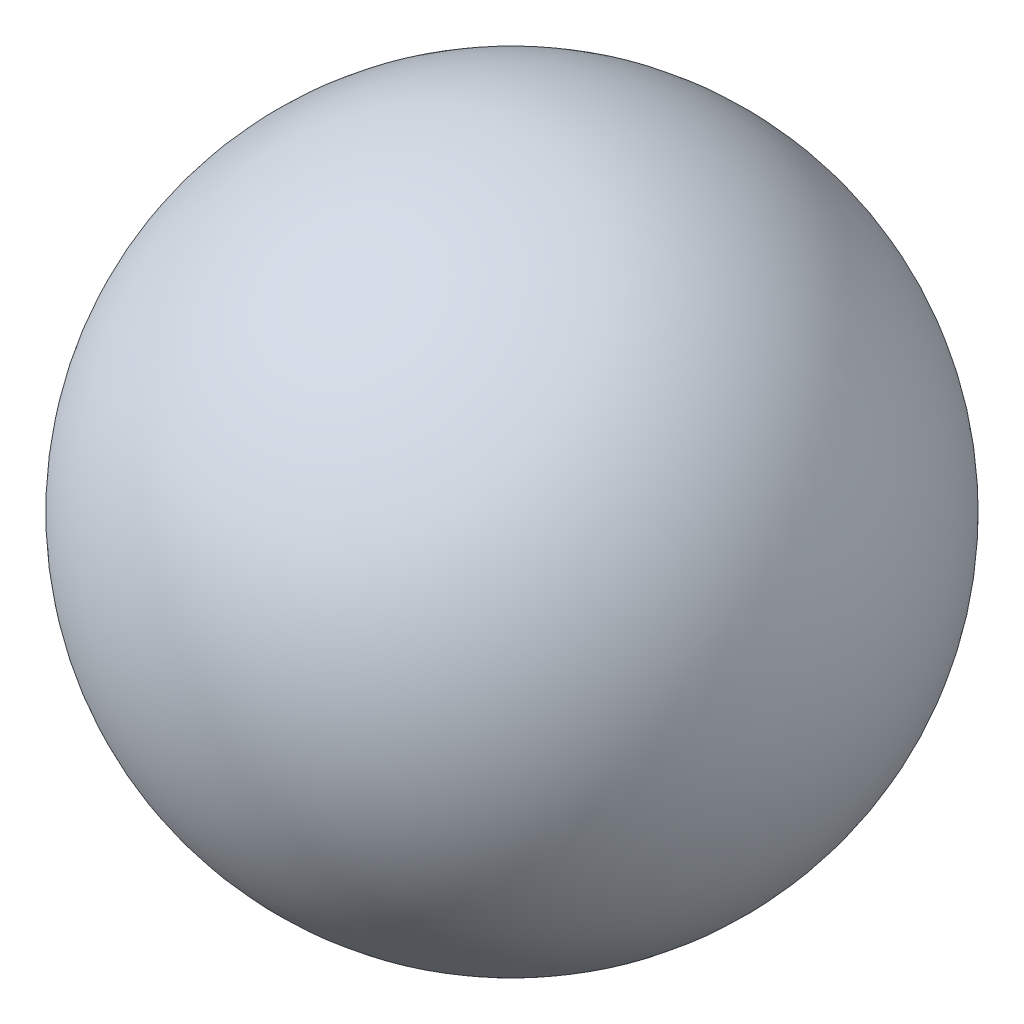
ISO-10303-21;
HEADER;
FILE_DESCRIPTION(('STEP AP214'),'2;1');
FILE_NAME('part.step','',(''),(''),'','','');
FILE_SCHEMA(('AUTOMOTIVE_DESIGN { 1 0 10303 214 1 1 1 1 }'));
ENDSEC;
DATA;
#1=APPLICATION_CONTEXT('core data for automotive mechanical design processes');
#2=APPLICATION_PROTOCOL_DEFINITION('international standard','automotive_design',2000,#1);
#3=PRODUCT_CONTEXT('',#1,'mechanical');
#4=PRODUCT('Part','Part','',(#3));
#5=PRODUCT_RELATED_PRODUCT_CATEGORY('part','',(#4));
#6=PRODUCT_DEFINITION_FORMATION('','',#4);
#7=PRODUCT_DEFINITION_CONTEXT('part definition',#1,'design');
#8=PRODUCT_DEFINITION('design','',#6,#7);
#9=PRODUCT_DEFINITION_SHAPE('','',#8);
#10=(LENGTH_UNIT() NAMED_UNIT(*) SI_UNIT(.MILLI.,.METRE.));
#11=(NAMED_UNIT(*) PLANE_ANGLE_UNIT() SI_UNIT($,.RADIAN.));
#12=(NAMED_UNIT(*) SI_UNIT($,.STERADIAN.) SOLID_ANGLE_UNIT());
#13=UNCERTAINTY_MEASURE_WITH_UNIT(LENGTH_MEASURE(1.E-05),#10,'distance_accuracy_value','');
#14=(GEOMETRIC_REPRESENTATION_CONTEXT(3) GLOBAL_UNCERTAINTY_ASSIGNED_CONTEXT((#13)) GLOBAL_UNIT_ASSIGNED_CONTEXT((#10,
#11,#12)) REPRESENTATION_CONTEXT('',''));
#15=CARTESIAN_POINT('',(0.,0.,0.));
#16=DIRECTION('',(0.,0.,1.));
#17=DIRECTION('',(1.,0.,0.));
#18=AXIS2_PLACEMENT_3D('',#15,#16,#17);
#19=CARTESIAN_POINT('',(0.,0.,0.));
#20=DIRECTION('',(0.,1.,0.));
#21=DIRECTION('',(0.,0.,-1.));
#22=AXIS2_PLACEMENT_3D('',#19,#20,#21);
#23=SPHERICAL_SURFACE('',#22,6.);
#24=CARTESIAN_POINT('',(0.,6.,0.));
#25=VERTEX_POINT('',#24);
#26=VERTEX_LOOP('',#25);
#27=FACE_BOUND('',#26,.T.);
#28=ADVANCED_FACE('F30',(#27),#23,.T.);
#29=CLOSED_SHELL('',(#28));
#30=CARTESIAN_POINT('',(-5.,0.,0.));
#31=DIRECTION('',(1.,0.,0.));
#32=DIRECTION('',(0.,0.,-1.));
#33=AXIS2_PLACEMENT_3D('',#30,#31,#32);
#34=CYLINDRICAL_SURFACE('',#33,1.5);
#35=CARTESIAN_POINT('',(0.,0.,0.));
#36=DIRECTION('',(0.707106781186547,-0.707106781186547,0.));
#37=DIRECTION('',(0.707106781186547,0.707106781186547,0.));
#38=AXIS2_PLACEMENT_3D('',#35,#36,#37);
#39=ELLIPSE('',#38,2.12132034355964,1.5);
#40=CARTESIAN_POINT('',(0.,0.,1.5));
#41=VERTEX_POINT('',#40);
#42=CARTESIAN_POINT('',(0.,0.,-1.5));
#43=VERTEX_POINT('',#42);
#44=EDGE_CURVE('E56',#41,#43,#39,.T.);
#45=ORIENTED_EDGE('',*,*,#44,.T.);
#46=CARTESIAN_POINT('',(0.,0.,0.));
#47=DIRECTION('',(0.707106781186547,0.707106781186547,0.));
#48=DIRECTION('',(0.707106781186547,-0.707106781186547,0.));
#49=AXIS2_PLACEMENT_3D('',#46,#47,#48);
#50=ELLIPSE('',#49,2.12132034355964,1.5);
#51=EDGE_CURVE('E61',#43,#41,#50,.T.);
#52=ORIENTED_EDGE('',*,*,#51,.T.);
#53=EDGE_LOOP('',(#45,#52));
#54=FACE_BOUND('',#53,.T.);
#55=CARTESIAN_POINT('',(-5.,0.,0.));
#56=DIRECTION('',(1.,0.,0.));
#57=DIRECTION('',(0.,0.,-1.));
#58=AXIS2_PLACEMENT_3D('',#55,#56,#57);
#59=CIRCLE('',#58,1.5);
#60=CARTESIAN_POINT('',(-5.,0.,-1.5));
#61=VERTEX_POINT('',#60);
#62=EDGE_CURVE('E11',#61,#61,#59,.T.);
#63=ORIENTED_EDGE('',*,*,#62,.F.);
#64=EDGE_LOOP('',(#63));
#65=FACE_BOUND('',#64,.T.);
#66=ADVANCED_FACE('F69',(#54,#65),#34,.F.);
#67=CARTESIAN_POINT('',(-5.,0.,0.));
#68=DIRECTION('',(1.,0.,0.));
#69=DIRECTION('',(0.,0.,-1.));
#70=AXIS2_PLACEMENT_3D('',#67,#68,#69);
#71=PLANE('',#70);
#72=ORIENTED_EDGE('',*,*,#62,.T.);
#73=EDGE_LOOP('',(#72));
#74=FACE_BOUND('',#73,.T.);
#75=ADVANCED_FACE('F113',(#74),#71,.T.);
#76=CARTESIAN_POINT('',(0.,5.,0.));
#77=DIRECTION('',(0.,1.,0.));
#78=DIRECTION('',(0.,0.,1.));
#79=AXIS2_PLACEMENT_3D('',#76,#77,#78);
#80=PLANE('',#79);
#81=CARTESIAN_POINT('',(0.,5.,0.));
#82=DIRECTION('',(0.,1.,0.));
#83=DIRECTION('',(0.,0.,1.));
#84=AXIS2_PLACEMENT_3D('',#81,#82,#83);
#85=CIRCLE('',#84,1.5);
#86=CARTESIAN_POINT('',(0.,5.,1.5));
#87=VERTEX_POINT('',#86);
#88=EDGE_CURVE('E239',#87,#87,#85,.T.);
#89=ORIENTED_EDGE('',*,*,#88,.F.);
#90=EDGE_LOOP('',(#89));
#91=FACE_BOUND('',#90,.T.);
#92=ADVANCED_FACE('F118',(#91),#80,.F.);
#93=CARTESIAN_POINT('',(0.,-5.,0.));
#94=DIRECTION('',(0.,1.,0.));
#95=DIRECTION('',(0.,0.,1.));
#96=AXIS2_PLACEMENT_3D('',#93,#94,#95);
#97=CYLINDRICAL_SURFACE('',#96,1.5);
#98=CARTESIAN_POINT('',(-1.4142135623731,2.5,-0.5));
#99=CARTESIAN_POINT('',(-1.41421347266367,2.52723408740534,-0.500000128973901));
#100=CARTESIAN_POINT('',(-1.41500884686403,2.55446739988576,-0.49776739184907));
#101=CARTESIAN_POINT('',(-1.4180878708729,2.60812721047531,-0.488925565851282));
#102=CARTESIAN_POINT('',(-1.4203717658361,2.63455357493197,-0.482315756085337));
#103=CARTESIAN_POINT('',(-1.42614101831944,2.68581344650641,-0.464977742840131));
#104=CARTESIAN_POINT('',(-1.4296240198232,2.71064996472344,-0.454257610701));
#105=CARTESIAN_POINT('',(-1.43739561008504,2.7581800242719,-0.429030814221313));
#106=CARTESIAN_POINT('',(-1.44168437652716,2.78087309127625,-0.414523314430261));
#107=CARTESIAN_POINT('',(-1.45077244702794,2.82435998116974,-0.381525573221263));
#108=CARTESIAN_POINT('',(-1.45558447422069,2.84505771433602,-0.362912170688912));
#109=CARTESIAN_POINT('',(-1.46506932400754,2.88310340061216,-0.322493833607244));
#110=CARTESIAN_POINT('',(-1.46974212414549,2.90045081579114,-0.3006883875262));
#111=CARTESIAN_POINT('',(-1.47856933460829,2.93173944866484,-0.253802253982491));
#112=CARTESIAN_POINT('',(-1.48270703850784,2.94557998530899,-0.228650955612258));
#113=CARTESIAN_POINT('',(-1.4898479338551,2.96879579256374,-0.17621561149374));
#114=CARTESIAN_POINT('',(-1.49285143101506,2.97817226658845,-0.148932142843606));
#115=CARTESIAN_POINT('',(-1.49729537715949,2.9918679273162,-0.0940144087167455));
#116=CARTESIAN_POINT('',(-1.49878657388779,2.9963517231285,-0.0664253774264829));
#117=CARTESIAN_POINT('',(-1.50021804109124,3.00065814668033,-0.0108489374120448));
#118=CARTESIAN_POINT('',(-1.50015871131445,3.00048197582621,0.0171383667719471));
#119=CARTESIAN_POINT('',(-1.49853019809368,2.99557787271698,0.0715517575969093));
#120=CARTESIAN_POINT('',(-1.49702032377569,2.99102873576275,0.0979960242958342));
#121=CARTESIAN_POINT('',(-1.49273483669855,2.97780350950977,0.149721719411081));
#122=CARTESIAN_POINT('',(-1.48995913815551,2.96912714051012,0.175003068889588));
#123=CARTESIAN_POINT('',(-1.48337835146652,2.94778934134693,0.224076237421007));
#124=CARTESIAN_POINT('',(-1.47956021262158,2.93507703072661,0.2478441104845));
#125=CARTESIAN_POINT('',(-1.47129196519309,2.90607014727581,0.292962162763585));
#126=CARTESIAN_POINT('',(-1.4668416810017,2.88977457833669,0.314311667192384));
#127=CARTESIAN_POINT('',(-1.45753095925538,2.85316280326962,0.355050433275955));
#128=CARTESIAN_POINT('',(-1.45266107586687,2.83269342107723,0.374300078533784));
#129=CARTESIAN_POINT('',(-1.44323667622202,2.78877563713872,0.40913862979794));
#130=CARTESIAN_POINT('',(-1.43868220864403,2.76532677714357,0.424726971636483));
#131=CARTESIAN_POINT('',(-1.43035262569106,2.7156731871921,0.451993727521386));
#132=CARTESIAN_POINT('',(-1.42658954674447,2.68943393431537,0.463613231825601));
#133=CARTESIAN_POINT('',(-1.42040825434116,2.6352143028676,0.482221596649677));
#134=CARTESIAN_POINT('',(-1.41798947731819,2.6072346593918,0.48921239787748));
#135=CARTESIAN_POINT('',(-1.41489818169014,2.55168082230333,0.498080641044514));
#136=CARTESIAN_POINT('',(-1.41415180223172,2.52414528763032,0.500174547752903));
#137=CARTESIAN_POINT('',(-1.41428336096614,2.4691119254414,0.499802719455807));
#138=CARTESIAN_POINT('',(-1.41516100413602,2.44161409198472,0.497337812612854));
#139=CARTESIAN_POINT('',(-1.41836809028099,2.38842151714123,0.488112825775626));
#140=CARTESIAN_POINT('',(-1.42064662715846,2.36269728492382,0.4815031969902));
#141=CARTESIAN_POINT('',(-1.42634276840086,2.31272819688116,0.464356931280375));
#142=CARTESIAN_POINT('',(-1.42976057468663,2.28848360420481,0.453819598181749));
#143=CARTESIAN_POINT('',(-1.4374843879661,2.24130978957629,0.428737170369428));
#144=CARTESIAN_POINT('',(-1.4418151283247,2.21844667867904,0.414075559179237));
#145=CARTESIAN_POINT('',(-1.45082884365827,2.1754269738082,0.38129281527879));
#146=CARTESIAN_POINT('',(-1.45551192221992,2.15527118066941,0.363170662749394));
#147=CARTESIAN_POINT('',(-1.46497519318826,2.11723600795466,0.322945852950159));
#148=CARTESIAN_POINT('',(-1.46974921788922,2.09951280499057,0.300693635273325));
#149=CARTESIAN_POINT('',(-1.47863425806581,2.06804192882598,0.253413645700129));
#150=CARTESIAN_POINT('',(-1.48274529708854,2.05429411441879,0.228385972432276));
#151=CARTESIAN_POINT('',(-1.48982202905295,2.03128994756914,0.176389931216147));
#152=CARTESIAN_POINT('',(-1.49279515002264,2.02200436142597,0.149435561660598));
#153=CARTESIAN_POINT('',(-1.49729305418889,2.00813612896995,0.094229232923008));
#154=CARTESIAN_POINT('',(-1.4988183601701,2.00355178505975,0.0659777459769445));
#155=CARTESIAN_POINT('',(-1.50020931618128,1.99936896119718,0.0104076679300201));
#156=CARTESIAN_POINT('',(-1.50014960044721,1.99954627303381,-0.0168923619600098));
#157=CARTESIAN_POINT('',(-1.49856098259698,2.0043286540732,-0.071055572500087));
#158=CARTESIAN_POINT('',(-1.49703219966784,2.00893336407638,-0.0979187884095278));
#159=CARTESIAN_POINT('',(-1.4927045747721,2.02229111728798,-0.15002105971603));
#160=CARTESIAN_POINT('',(-1.4899262918059,2.03097710767648,-0.175279135456398));
#161=CARTESIAN_POINT('',(-1.48338580352232,2.05218876554857,-0.223989175469895));
#162=CARTESIAN_POINT('',(-1.4796234202395,2.06471512759847,-0.247440812071205));
#163=CARTESIAN_POINT('',(-1.47132934414,2.09378475605104,-0.292817008154405));
#164=CARTESIAN_POINT('',(-1.46677436246191,2.11045934269096,-0.314653125778848));
#165=CARTESIAN_POINT('',(-1.45746494395712,2.14712869557796,-0.355290513136169));
#166=CARTESIAN_POINT('',(-1.45271044385698,2.16712452113084,-0.37409081081213));
#167=CARTESIAN_POINT('',(-1.44331639913682,2.21080467779402,-0.408870904416732));
#168=CARTESIAN_POINT('',(-1.43868863997672,2.23460275549038,-0.424711482999608));
#169=CARTESIAN_POINT('',(-1.43030096658152,2.28466721344933,-0.4521571716499));
#170=CARTESIAN_POINT('',(-1.42654082568085,2.31093294650712,-0.46376338840728));
#171=CARTESIAN_POINT('',(-1.42050667115267,2.36398091201192,-0.481921914103313));
#172=CARTESIAN_POINT('',(-1.418173164724,2.39068613178286,-0.488678954581634));
#173=CARTESIAN_POINT('',(-1.4150269180697,2.44492802525774,-0.497717160080847));
#174=CARTESIAN_POINT('',(-1.41421365307568,2.47246440871787,-0.499999869598251));
#175=CARTESIAN_POINT('',(-1.4142135623731,2.5,-0.5));
#176=B_SPLINE_CURVE_WITH_KNOTS('',3,(#98,#99,#100,#101,#102,#103,#104,#105,#106,#107,#108,#109,
#110,#111,#112,#113,#114,#115,#116,#117,#118,#119,#120,#121,#122,#123,#124,#125,#126,#127,#128,
#129,#130,#131,#132,#133,#134,#135,#136,#137,#138,#139,#140,#141,#142,#143,#144,#145,#146,#147,
#148,#149,#150,#151,#152,#153,#154,#155,#156,#157,#158,#159,#160,#161,#162,#163,#164,#165,#166,
#167,#168,#169,#170,#171,#172,#173,#174,#175),.UNSPECIFIED.,.T.,.F.,(4,2,2,2,2,2,2,2,2,2,2,2,2,
2,2,2,2,2,2,2,2,2,2,2,2,2,2,2,2,2,2,2,2,2,2,2,2,2,4),(0.,0.0816002923877087,0.16321402748444,
0.244668313727272,0.32614058306958,0.4105066871147,0.494886325836799,0.581467530695145,
0.668025381910804,0.75157159380153,0.835096266488495,0.915345024104704,0.995599220923042,
1.07690827427853,1.15823995934697,1.24340087179645,1.32857489803739,1.41496319918688,
1.50131525674844,1.58377145676863,1.66621267911373,1.74582197877144,1.82544539566229,
1.90759428860613,1.9897674282382,2.07589404078302,2.16201759371522,2.24756895588182,
2.33308941494834,2.41459042331574,2.49608481997646,2.57628478012971,2.65649925374377,
2.73967759753073,2.82288252209072,2.90934451360828,2.99578389126189,3.07831606073062,
3.16081973585834),.UNSPECIFIED.);
#177=CARTESIAN_POINT('',(-1.4142135623731,2.5,-0.5));
#178=VERTEX_POINT('',#177);
#179=EDGE_CURVE('E33',#178,#178,#176,.T.);
#180=ORIENTED_EDGE('',*,*,#179,.F.);
#181=EDGE_LOOP('',(#180));
#182=FACE_BOUND('',#181,.T.);
#183=ORIENTED_EDGE('',*,*,#88,.T.);
#184=EDGE_LOOP('',(#183));
#185=FACE_BOUND('',#184,.T.);
#186=CARTESIAN_POINT('',(1.4142135623731,2.5,-0.5));
#187=CARTESIAN_POINT('',(1.41421347266367,2.47276591259466,-0.500000128973901));
#188=CARTESIAN_POINT('',(1.41500884686403,2.44553260011424,-0.49776739184907));
#189=CARTESIAN_POINT('',(1.4180878708729,2.39187278952469,-0.488925565851282));
#190=CARTESIAN_POINT('',(1.4203717658361,2.36544642506803,-0.482315756085337));
#191=CARTESIAN_POINT('',(1.42614101831944,2.31418655349359,-0.464977742840131));
#192=CARTESIAN_POINT('',(1.4296240198232,2.28935003527656,-0.454257610701));
#193=CARTESIAN_POINT('',(1.43739561008504,2.2418199757281,-0.429030814221313));
#194=CARTESIAN_POINT('',(1.44168437652716,2.21912690872375,-0.414523314430261));
#195=CARTESIAN_POINT('',(1.45077244702794,2.17564001883026,-0.381525573221263));
#196=CARTESIAN_POINT('',(1.45558447422069,2.15494228566398,-0.362912170688912));
#197=CARTESIAN_POINT('',(1.46506932400754,2.11689659938784,-0.322493833607244));
#198=CARTESIAN_POINT('',(1.46974212414549,2.09954918420886,-0.3006883875262));
#199=CARTESIAN_POINT('',(1.47856933460829,2.06826055133516,-0.253802253982491));
#200=CARTESIAN_POINT('',(1.48270703850784,2.05442001469101,-0.228650955612258));
#201=CARTESIAN_POINT('',(1.4898479338551,2.03120420743626,-0.17621561149374));
#202=CARTESIAN_POINT('',(1.49285143101506,2.02182773341155,-0.148932142843606));
#203=CARTESIAN_POINT('',(1.49729537715949,2.0081320726838,-0.0940144087167455));
#204=CARTESIAN_POINT('',(1.49878657388779,2.0036482768715,-0.0664253774264829));
#205=CARTESIAN_POINT('',(1.50021804109124,1.99934185331967,-0.0108489374120448));
#206=CARTESIAN_POINT('',(1.50015871131445,1.99951802417379,0.0171383667719471));
#207=CARTESIAN_POINT('',(1.49853019809368,2.00442212728302,0.0715517575969093));
#208=CARTESIAN_POINT('',(1.49702032377569,2.00897126423725,0.0979960242958342));
#209=CARTESIAN_POINT('',(1.49273483669855,2.02219649049023,0.149721719411081));
#210=CARTESIAN_POINT('',(1.48995913815551,2.03087285948988,0.175003068889588));
#211=CARTESIAN_POINT('',(1.48337835146652,2.05221065865307,0.224076237421007));
#212=CARTESIAN_POINT('',(1.47956021262158,2.06492296927339,0.2478441104845));
#213=CARTESIAN_POINT('',(1.47129196519309,2.09392985272419,0.292962162763585));
#214=CARTESIAN_POINT('',(1.4668416810017,2.11022542166331,0.314311667192384));
#215=CARTESIAN_POINT('',(1.45753095925538,2.14683719673038,0.355050433275955));
#216=CARTESIAN_POINT('',(1.45266107586687,2.16730657892277,0.374300078533784));
#217=CARTESIAN_POINT('',(1.44323667622202,2.21122436286128,0.40913862979794));
#218=CARTESIAN_POINT('',(1.43868220864403,2.23467322285643,0.424726971636483));
#219=CARTESIAN_POINT('',(1.43035262569106,2.2843268128079,0.451993727521387));
#220=CARTESIAN_POINT('',(1.42658954674447,2.31056606568463,0.463613231825601));
#221=CARTESIAN_POINT('',(1.42040825434116,2.36478569713241,0.482221596649677));
#222=CARTESIAN_POINT('',(1.41798947731819,2.3927653406082,0.48921239787748));
#223=CARTESIAN_POINT('',(1.41489818169014,2.44831917769667,0.498080641044514));
#224=CARTESIAN_POINT('',(1.41415180223172,2.47585471236968,0.500174547752903));
#225=CARTESIAN_POINT('',(1.41428336096614,2.5308880745586,0.499802719455807));
#226=CARTESIAN_POINT('',(1.41516100413602,2.55838590801528,0.497337812612854));
#227=CARTESIAN_POINT('',(1.41836809028099,2.61157848285877,0.488112825775626));
#228=CARTESIAN_POINT('',(1.42064662715846,2.63730271507618,0.4815031969902));
#229=CARTESIAN_POINT('',(1.42634276840086,2.68727180311884,0.464356931280375));
#230=CARTESIAN_POINT('',(1.42976057468663,2.71151639579519,0.453819598181749));
#231=CARTESIAN_POINT('',(1.4374843879661,2.75869021042371,0.428737170369428));
#232=CARTESIAN_POINT('',(1.4418151283247,2.78155332132096,0.414075559179238));
#233=CARTESIAN_POINT('',(1.45082884365827,2.8245730261918,0.38129281527879));
#234=CARTESIAN_POINT('',(1.45551192221992,2.84472881933059,0.363170662749394));
#235=CARTESIAN_POINT('',(1.46497519318826,2.88276399204534,0.322945852950159));
#236=CARTESIAN_POINT('',(1.46974921788922,2.90048719500943,0.300693635273325));
#237=CARTESIAN_POINT('',(1.47863425806581,2.93195807117402,0.253413645700129));
#238=CARTESIAN_POINT('',(1.48274529708854,2.94570588558121,0.228385972432276));
#239=CARTESIAN_POINT('',(1.48982202905295,2.96871005243086,0.176389931216147));
#240=CARTESIAN_POINT('',(1.49279515002264,2.97799563857403,0.149435561660598));
#241=CARTESIAN_POINT('',(1.49729305418889,2.99186387103005,0.094229232923008));
#242=CARTESIAN_POINT('',(1.4988183601701,2.99644821494025,0.0659777459769445));
#243=CARTESIAN_POINT('',(1.50020931618128,3.00063103880282,0.0104076679300201));
#244=CARTESIAN_POINT('',(1.50014960044721,3.00045372696619,-0.0168923619600098));
#245=CARTESIAN_POINT('',(1.49856098259698,2.9956713459268,-0.071055572500087));
#246=CARTESIAN_POINT('',(1.49703219966784,2.99106663592362,-0.0979187884095278));
#247=CARTESIAN_POINT('',(1.4927045747721,2.97770888271202,-0.15002105971603));
#248=CARTESIAN_POINT('',(1.4899262918059,2.96902289232352,-0.175279135456398));
#249=CARTESIAN_POINT('',(1.48338580352232,2.94781123445143,-0.223989175469895));
#250=CARTESIAN_POINT('',(1.4796234202395,2.93528487240153,-0.247440812071205));
#251=CARTESIAN_POINT('',(1.47132934414,2.90621524394896,-0.292817008154404));
#252=CARTESIAN_POINT('',(1.46677436246191,2.88954065730904,-0.314653125778848));
#253=CARTESIAN_POINT('',(1.45746494395712,2.85287130442204,-0.355290513136169));
#254=CARTESIAN_POINT('',(1.45271044385699,2.83287547886916,-0.37409081081213));
#255=CARTESIAN_POINT('',(1.44331639913682,2.78919532220598,-0.408870904416732));
#256=CARTESIAN_POINT('',(1.43868863997672,2.76539724450962,-0.424711482999608));
#257=CARTESIAN_POINT('',(1.43030096658152,2.71533278655067,-0.4521571716499));
#258=CARTESIAN_POINT('',(1.42654082568085,2.68906705349288,-0.46376338840728));
#259=CARTESIAN_POINT('',(1.42050667115267,2.63601908798808,-0.481921914103313));
#260=CARTESIAN_POINT('',(1.418173164724,2.60931386821714,-0.488678954581634));
#261=CARTESIAN_POINT('',(1.4150269180697,2.55507197474226,-0.497717160080847));
#262=CARTESIAN_POINT('',(1.41421365307568,2.52753559128213,-0.499999869598251));
#263=CARTESIAN_POINT('',(1.4142135623731,2.5,-0.5));
#264=B_SPLINE_CURVE_WITH_KNOTS('',3,(#186,#187,#188,#189,#190,#191,#192,#193,#194,#195,#196,
#197,#198,#199,#200,#201,#202,#203,#204,#205,#206,#207,#208,#209,#210,#211,#212,#213,#214,#215,
#216,#217,#218,#219,#220,#221,#222,#223,#224,#225,#226,#227,#228,#229,#230,#231,#232,#233,#234,
#235,#236,#237,#238,#239,#240,#241,#242,#243,#244,#245,#246,#247,#248,#249,#250,#251,#252,#253,
#254,#255,#256,#257,#258,#259,#260,#261,#262,#263),.UNSPECIFIED.,.T.,.F.,(4,2,2,2,2,2,2,2,2,2,2,
2,2,2,2,2,2,2,2,2,2,2,2,2,2,2,2,2,2,2,2,2,2,2,2,2,2,2,4),(0.,0.0816002923877087,
0.16321402748444,0.244668313727272,0.32614058306958,0.4105066871147,0.494886325836799,
0.581467530695145,0.668025381910804,0.75157159380153,0.835096266488495,0.915345024104704,
0.995599220923042,1.07690827427853,1.15823995934697,1.24340087179645,1.32857489803739,
1.41496319918688,1.50131525674844,1.58377145676863,1.66621267911373,1.74582197877144,
1.82544539566229,1.90759428860613,1.9897674282382,2.07589404078302,2.16201759371522,
2.24756895588182,2.33308941494834,2.41459042331574,2.49608481997646,2.57628478012971,
2.65649925374377,2.73967759753073,2.82288252209072,2.90934451360828,2.99578389126189,
3.07831606073062,3.16081973585834),.UNSPECIFIED.);
#265=CARTESIAN_POINT('',(1.4142135623731,2.5,-0.5));
#266=VERTEX_POINT('',#265);
#267=EDGE_CURVE('E79',#266,#266,#264,.T.);
#268=ORIENTED_EDGE('',*,*,#267,.F.);
#269=EDGE_LOOP('',(#268));
#270=FACE_BOUND('',#269,.T.);
#271=CARTESIAN_POINT('',(0.,0.,0.));
#272=DIRECTION('',(0.707106781186547,-0.707106781186547,0.));
#273=DIRECTION('',(0.707106781186547,0.707106781186547,0.));
#274=AXIS2_PLACEMENT_3D('',#271,#272,#273);
#275=ELLIPSE('',#274,2.12132034355964,1.5);
#276=EDGE_CURVE('E50',#41,#43,#275,.F.);
#277=ORIENTED_EDGE('',*,*,#276,.F.);
#278=ORIENTED_EDGE('',*,*,#51,.F.);
#279=EDGE_LOOP('',(#277,#278));
#280=FACE_BOUND('',#279,.T.);
#281=ADVANCED_FACE('F64',(#182,#185,#270,#280),#97,.F.);
#282=CARTESIAN_POINT('',(-5.,2.5,0.));
#283=DIRECTION('',(1.,0.,0.));
#284=DIRECTION('',(0.,0.,-1.));
#285=AXIS2_PLACEMENT_3D('',#282,#283,#284);
#286=CYLINDRICAL_SURFACE('',#285,0.5);
#287=ORIENTED_EDGE('',*,*,#179,.T.);
#288=EDGE_LOOP('',(#287));
#289=FACE_BOUND('',#288,.T.);
#290=CARTESIAN_POINT('',(-5.,2.5,0.));
#291=DIRECTION('',(1.,0.,0.));
#292=DIRECTION('',(0.,0.,-1.));
#293=AXIS2_PLACEMENT_3D('',#290,#291,#292);
#294=CIRCLE('',#293,0.5);
#295=CARTESIAN_POINT('',(-5.,2.5,-0.5));
#296=VERTEX_POINT('',#295);
#297=EDGE_CURVE('E75',#296,#296,#294,.T.);
#298=ORIENTED_EDGE('',*,*,#297,.F.);
#299=EDGE_LOOP('',(#298));
#300=FACE_BOUND('',#299,.T.);
#301=ADVANCED_FACE('F103',(#289,#300),#286,.F.);
#302=CARTESIAN_POINT('',(-5.,2.5,0.));
#303=DIRECTION('',(1.,0.,0.));
#304=DIRECTION('',(0.,0.,-1.));
#305=AXIS2_PLACEMENT_3D('',#302,#303,#304);
#306=PLANE('',#305);
#307=ORIENTED_EDGE('',*,*,#297,.T.);
#308=EDGE_LOOP('',(#307));
#309=FACE_BOUND('',#308,.T.);
#310=ADVANCED_FACE('F100',(#309),#306,.T.);
#311=CARTESIAN_POINT('',(5.,0.,0.));
#312=DIRECTION('',(1.,0.,0.));
#313=DIRECTION('',(0.,0.,-1.));
#314=AXIS2_PLACEMENT_3D('',#311,#312,#313);
#315=PLANE('',#314);
#316=CARTESIAN_POINT('',(5.,0.,0.));
#317=DIRECTION('',(1.,0.,0.));
#318=DIRECTION('',(0.,0.,-1.));
#319=AXIS2_PLACEMENT_3D('',#316,#317,#318);
#320=CIRCLE('',#319,1.5);
#321=CARTESIAN_POINT('',(5.,0.,-1.5));
#322=VERTEX_POINT('',#321);
#323=EDGE_CURVE('E43',#322,#322,#320,.T.);
#324=ORIENTED_EDGE('',*,*,#323,.F.);
#325=EDGE_LOOP('',(#324));
#326=FACE_BOUND('',#325,.T.);
#327=ADVANCED_FACE('F102',(#326),#315,.F.);
#328=ORIENTED_EDGE('',*,*,#323,.T.);
#329=EDGE_LOOP('',(#328));
#330=FACE_BOUND('',#329,.T.);
#331=ORIENTED_EDGE('',*,*,#276,.T.);
#332=CARTESIAN_POINT('',(0.,0.,0.));
#333=DIRECTION('',(0.707106781186547,0.707106781186547,0.));
#334=DIRECTION('',(0.707106781186547,-0.707106781186547,0.));
#335=AXIS2_PLACEMENT_3D('',#332,#333,#334);
#336=ELLIPSE('',#335,2.12132034355964,1.5);
#337=EDGE_CURVE('E58',#43,#41,#336,.F.);
#338=ORIENTED_EDGE('',*,*,#337,.T.);
#339=EDGE_LOOP('',(#331,#338));
#340=FACE_BOUND('',#339,.T.);
#341=ADVANCED_FACE('F66',(#330,#340),#34,.F.);
#342=CARTESIAN_POINT('',(0.,-5.,0.));
#343=DIRECTION('',(0.,1.,0.));
#344=DIRECTION('',(0.,0.,1.));
#345=AXIS2_PLACEMENT_3D('',#342,#343,#344);
#346=CIRCLE('',#345,1.5);
#347=CARTESIAN_POINT('',(0.,-5.,1.5));
#348=VERTEX_POINT('',#347);
#349=EDGE_CURVE('E83',#348,#348,#346,.T.);
#350=ORIENTED_EDGE('',*,*,#349,.F.);
#351=EDGE_LOOP('',(#350));
#352=FACE_BOUND('',#351,.T.);
#353=ORIENTED_EDGE('',*,*,#44,.F.);
#354=ORIENTED_EDGE('',*,*,#337,.F.);
#355=EDGE_LOOP('',(#353,#354));
#356=FACE_BOUND('',#355,.T.);
#357=ADVANCED_FACE('F57',(#352,#356),#97,.F.);
#358=CARTESIAN_POINT('',(0.,-5.,0.));
#359=DIRECTION('',(0.,1.,0.));
#360=DIRECTION('',(0.,0.,1.));
#361=AXIS2_PLACEMENT_3D('',#358,#359,#360);
#362=PLANE('',#361);
#363=ORIENTED_EDGE('',*,*,#349,.T.);
#364=EDGE_LOOP('',(#363));
#365=FACE_BOUND('',#364,.T.);
#366=ADVANCED_FACE('F92',(#365),#362,.T.);
#367=CARTESIAN_POINT('',(5.,2.5,0.));
#368=DIRECTION('',(1.,0.,0.));
#369=DIRECTION('',(0.,0.,-1.));
#370=AXIS2_PLACEMENT_3D('',#367,#368,#369);
#371=PLANE('',#370);
#372=CARTESIAN_POINT('',(5.,2.5,0.));
#373=DIRECTION('',(1.,0.,0.));
#374=DIRECTION('',(0.,0.,-1.));
#375=AXIS2_PLACEMENT_3D('',#372,#373,#374);
#376=CIRCLE('',#375,0.5);
#377=CARTESIAN_POINT('',(5.,2.5,-0.5));
#378=VERTEX_POINT('',#377);
#379=EDGE_CURVE('E67',#378,#378,#376,.T.);
#380=ORIENTED_EDGE('',*,*,#379,.F.);
#381=EDGE_LOOP('',(#380));
#382=FACE_BOUND('',#381,.T.);
#383=ADVANCED_FACE('F96',(#382),#371,.F.);
#384=ORIENTED_EDGE('',*,*,#267,.T.);
#385=EDGE_LOOP('',(#384));
#386=FACE_BOUND('',#385,.T.);
#387=ORIENTED_EDGE('',*,*,#379,.T.);
#388=EDGE_LOOP('',(#387));
#389=FACE_BOUND('',#388,.T.);
#390=ADVANCED_FACE('F84',(#386,#389),#286,.F.);
#391=CLOSED_SHELL('',(#66,#75,#92,#281,#301,#310,#327,#341,#357,#366,#383,#390));
#392=CARTESIAN_POINT('',(0.,-5.,-2.5));
#393=DIRECTION('',(0.,1.,0.));
#394=DIRECTION('',(0.,0.,1.));
#395=AXIS2_PLACEMENT_3D('',#392,#393,#394);
#396=CYLINDRICAL_SURFACE('',#395,0.5);
#397=CARTESIAN_POINT('',(0.,-5.,-2.5));
#398=DIRECTION('',(0.,1.,0.));
#399=DIRECTION('',(0.,0.,1.));
#400=AXIS2_PLACEMENT_3D('',#397,#398,#399);
#401=CIRCLE('',#400,0.5);
#402=CARTESIAN_POINT('',(0.,-5.,-2.));
#403=VERTEX_POINT('',#402);
#404=EDGE_CURVE('E241',#403,#403,#401,.T.);
#405=ORIENTED_EDGE('',*,*,#404,.F.);
#406=EDGE_LOOP('',(#405));
#407=FACE_BOUND('',#406,.T.);
#408=CARTESIAN_POINT('',(0.,5.,-2.5));
#409=DIRECTION('',(0.,1.,0.));
#410=DIRECTION('',(0.,0.,1.));
#411=AXIS2_PLACEMENT_3D('',#408,#409,#410);
#412=CIRCLE('',#411,0.5);
#413=CARTESIAN_POINT('',(0.,5.,-2.));
#414=VERTEX_POINT('',#413);
#415=EDGE_CURVE('E246',#414,#414,#412,.T.);
#416=ORIENTED_EDGE('',*,*,#415,.T.);
#417=EDGE_LOOP('',(#416));
#418=FACE_BOUND('',#417,.T.);
#419=ADVANCED_FACE('F153',(#407,#418),#396,.F.);
#420=CARTESIAN_POINT('',(0.,-5.,-2.5));
#421=DIRECTION('',(0.,1.,0.));
#422=DIRECTION('',(0.,0.,1.));
#423=AXIS2_PLACEMENT_3D('',#420,#421,#422);
#424=PLANE('',#423);
#425=ORIENTED_EDGE('',*,*,#404,.T.);
#426=EDGE_LOOP('',(#425));
#427=FACE_BOUND('',#426,.T.);
#428=ADVANCED_FACE('F156',(#427),#424,.T.);
#429=CARTESIAN_POINT('',(0.,5.,-2.5));
#430=DIRECTION('',(0.,1.,0.));
#431=DIRECTION('',(0.,0.,1.));
#432=AXIS2_PLACEMENT_3D('',#429,#430,#431);
#433=PLANE('',#432);
#434=ORIENTED_EDGE('',*,*,#415,.F.);
#435=EDGE_LOOP('',(#434));
#436=FACE_BOUND('',#435,.T.);
#437=ADVANCED_FACE('F165',(#436),#433,.F.);
#438=CLOSED_SHELL('',(#419,#428,#437));
#439=ORIENTED_CLOSED_SHELL('',*,#29,.T.);
#440=ORIENTED_CLOSED_SHELL('',*,#438,.T.);
#441=BREP_WITH_VOIDS('B2',#391,(#439,#440));
#442=ADVANCED_BREP_SHAPE_REPRESENTATION('',(#18,#441),#14);
#443=SHAPE_DEFINITION_REPRESENTATION(#9,#442);
ENDSEC;
END-ISO-10303-21;
